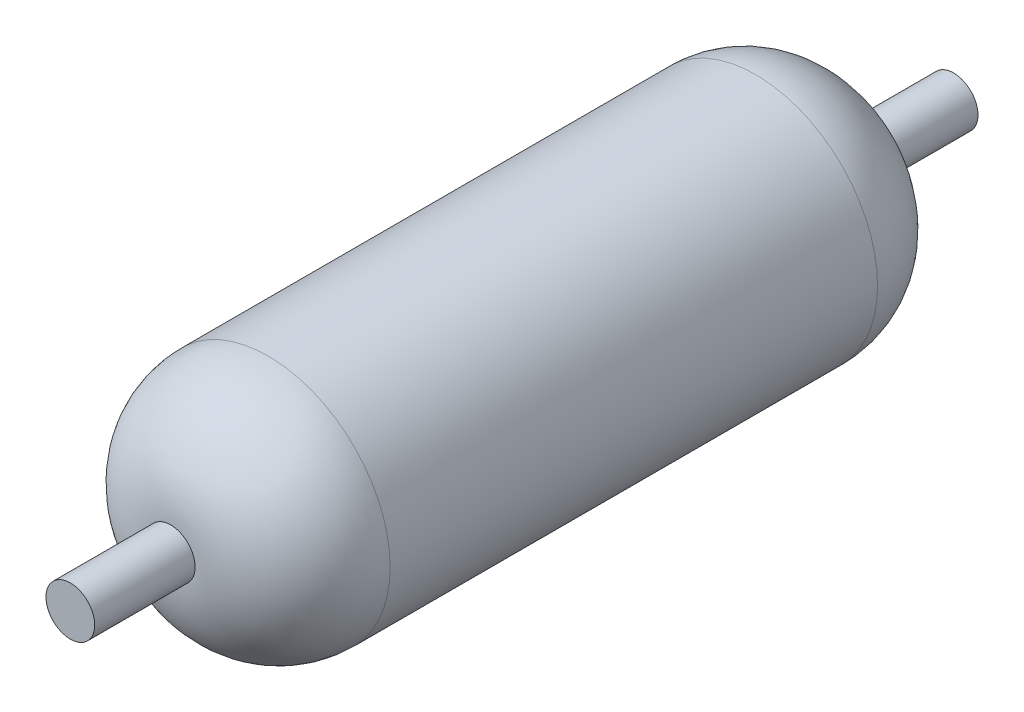
ISO-10303-21;
HEADER;
FILE_DESCRIPTION(('STEP AP214'),'2;1');
FILE_NAME('part.step','',(''),(''),'','','');
FILE_SCHEMA(('AUTOMOTIVE_DESIGN { 1 0 10303 214 1 1 1 1 }'));
ENDSEC;
DATA;
#1=APPLICATION_CONTEXT('core data for automotive mechanical design processes');
#2=APPLICATION_PROTOCOL_DEFINITION('international standard','automotive_design',2000,#1);
#3=PRODUCT_CONTEXT('',#1,'mechanical');
#4=PRODUCT('Part','Part','',(#3));
#5=PRODUCT_RELATED_PRODUCT_CATEGORY('part','',(#4));
#6=PRODUCT_DEFINITION_FORMATION('','',#4);
#7=PRODUCT_DEFINITION_CONTEXT('part definition',#1,'design');
#8=PRODUCT_DEFINITION('design','',#6,#7);
#9=PRODUCT_DEFINITION_SHAPE('','',#8);
#10=(LENGTH_UNIT() NAMED_UNIT(*) SI_UNIT(.MILLI.,.METRE.));
#11=(NAMED_UNIT(*) PLANE_ANGLE_UNIT() SI_UNIT($,.RADIAN.));
#12=(NAMED_UNIT(*) SI_UNIT($,.STERADIAN.) SOLID_ANGLE_UNIT());
#13=UNCERTAINTY_MEASURE_WITH_UNIT(LENGTH_MEASURE(1.E-05),#10,'distance_accuracy_value','');
#14=(GEOMETRIC_REPRESENTATION_CONTEXT(3) GLOBAL_UNCERTAINTY_ASSIGNED_CONTEXT((#13)) GLOBAL_UNIT_ASSIGNED_CONTEXT((#10,
#11,#12)) REPRESENTATION_CONTEXT('',''));
#15=CARTESIAN_POINT('',(0.,0.,0.));
#16=DIRECTION('',(0.,0.,1.));
#17=DIRECTION('',(1.,0.,0.));
#18=AXIS2_PLACEMENT_3D('',#15,#16,#17);
#19=CARTESIAN_POINT('',(0.,0.,4.53));
#20=DIRECTION('',(0.,0.,-1.));
#21=DIRECTION('',(-1.,0.,0.));
#22=AXIS2_PLACEMENT_3D('',#19,#20,#21);
#23=CYLINDRICAL_SURFACE('',#22,0.25);
#24=CARTESIAN_POINT('',(0.,0.,4.53));
#25=DIRECTION('',(0.,0.,1.));
#26=DIRECTION('',(1.,0.,0.));
#27=AXIS2_PLACEMENT_3D('',#24,#25,#26);
#28=CIRCLE('',#27,0.25);
#29=CARTESIAN_POINT('',(0.25,0.,4.53));
#30=VERTEX_POINT('',#29);
#31=EDGE_CURVE('E11',#30,#30,#28,.T.);
#32=ORIENTED_EDGE('',*,*,#31,.F.);
#33=EDGE_LOOP('',(#32));
#34=FACE_BOUND('',#33,.T.);
#35=CARTESIAN_POINT('',(0.,0.,-4.53));
#36=DIRECTION('',(0.,0.,1.));
#37=DIRECTION('',(1.,0.,0.));
#38=AXIS2_PLACEMENT_3D('',#35,#36,#37);
#39=CIRCLE('',#38,0.25);
#40=CARTESIAN_POINT('',(0.25,0.,-4.53));
#41=VERTEX_POINT('',#40);
#42=EDGE_CURVE('E41',#41,#41,#39,.T.);
#43=ORIENTED_EDGE('',*,*,#42,.T.);
#44=EDGE_LOOP('',(#43));
#45=FACE_BOUND('',#44,.T.);
#46=ADVANCED_FACE('F38',(#34,#45),#23,.T.);
#47=CARTESIAN_POINT('',(0.,0.,4.53));
#48=DIRECTION('',(0.,0.,1.));
#49=DIRECTION('',(1.,0.,0.));
#50=AXIS2_PLACEMENT_3D('',#47,#48,#49);
#51=PLANE('',#50);
#52=ORIENTED_EDGE('',*,*,#31,.T.);
#53=EDGE_LOOP('',(#52));
#54=FACE_BOUND('',#53,.T.);
#55=ADVANCED_FACE('F53',(#54),#51,.T.);
#56=CARTESIAN_POINT('',(0.,0.,-4.53));
#57=DIRECTION('',(0.,0.,1.));
#58=DIRECTION('',(1.,0.,0.));
#59=AXIS2_PLACEMENT_3D('',#56,#57,#58);
#60=PLANE('',#59);
#61=ORIENTED_EDGE('',*,*,#42,.F.);
#62=EDGE_LOOP('',(#61));
#63=FACE_BOUND('',#62,.T.);
#64=ADVANCED_FACE('F51',(#63),#60,.F.);
#65=CLOSED_SHELL('',(#46,#55,#64));
#66=MANIFOLD_SOLID_BREP('B2',#65);
#67=CARTESIAN_POINT('',(0.,0.,3.5));
#68=DIRECTION('',(0.,0.,-1.));
#69=DIRECTION('',(-1.,0.,0.));
#70=AXIS2_PLACEMENT_3D('',#67,#68,#69);
#71=CYLINDRICAL_SURFACE('',#70,1.25);
#72=CARTESIAN_POINT('',(0.,0.,2.5));
#73=DIRECTION('',(0.,0.,1.));
#74=DIRECTION('',(1.,0.,0.));
#75=AXIS2_PLACEMENT_3D('',#72,#73,#74);
#76=CIRCLE('',#75,1.25);
#77=CARTESIAN_POINT('',(1.25,0.,2.5));
#78=VERTEX_POINT('',#77);
#79=EDGE_CURVE('E85',#78,#78,#76,.F.);
#80=ORIENTED_EDGE('',*,*,#79,.T.);
#81=EDGE_LOOP('',(#80));
#82=FACE_BOUND('',#81,.T.);
#83=CARTESIAN_POINT('',(0.,0.,-2.5));
#84=DIRECTION('',(0.,0.,1.));
#85=DIRECTION('',(1.,0.,0.));
#86=AXIS2_PLACEMENT_3D('',#83,#84,#85);
#87=CIRCLE('',#86,1.25);
#88=CARTESIAN_POINT('',(1.25,0.,-2.5));
#89=VERTEX_POINT('',#88);
#90=EDGE_CURVE('E89',#89,#89,#87,.T.);
#91=ORIENTED_EDGE('',*,*,#90,.T.);
#92=EDGE_LOOP('',(#91));
#93=FACE_BOUND('',#92,.T.);
#94=ADVANCED_FACE('F78',(#82,#93),#71,.T.);
#95=CARTESIAN_POINT('',(0.,0.,3.5));
#96=DIRECTION('',(0.,0.,1.));
#97=DIRECTION('',(1.,0.,0.));
#98=AXIS2_PLACEMENT_3D('',#95,#96,#97);
#99=PLANE('',#98);
#100=CARTESIAN_POINT('',(0.,0.,3.5));
#101=DIRECTION('',(0.,0.,1.));
#102=DIRECTION('',(1.,0.,0.));
#103=AXIS2_PLACEMENT_3D('',#100,#101,#102);
#104=CIRCLE('',#103,0.25);
#105=CARTESIAN_POINT('',(0.25,0.,3.5));
#106=VERTEX_POINT('',#105);
#107=EDGE_CURVE('E93',#106,#106,#104,.T.);
#108=ORIENTED_EDGE('',*,*,#107,.T.);
#109=EDGE_LOOP('',(#108));
#110=FACE_BOUND('',#109,.T.);
#111=ADVANCED_FACE('F99',(#110),#99,.T.);
#112=CARTESIAN_POINT('',(0.,0.,-3.5));
#113=DIRECTION('',(0.,0.,1.));
#114=DIRECTION('',(1.,0.,0.));
#115=AXIS2_PLACEMENT_3D('',#112,#113,#114);
#116=PLANE('',#115);
#117=CARTESIAN_POINT('',(0.,0.,-3.5));
#118=DIRECTION('',(0.,0.,1.));
#119=DIRECTION('',(1.,0.,0.));
#120=AXIS2_PLACEMENT_3D('',#117,#118,#119);
#121=CIRCLE('',#120,0.25);
#122=CARTESIAN_POINT('',(0.25,0.,-3.5));
#123=VERTEX_POINT('',#122);
#124=EDGE_CURVE('E37',#123,#123,#121,.F.);
#125=ORIENTED_EDGE('',*,*,#124,.T.);
#126=EDGE_LOOP('',(#125));
#127=FACE_BOUND('',#126,.T.);
#128=ADVANCED_FACE('F103',(#127),#116,.F.);
#129=CARTESIAN_POINT('',(0.,0.,2.5));
#130=DIRECTION('',(0.,0.,1.));
#131=DIRECTION('',(1.,0.,0.));
#132=AXIS2_PLACEMENT_3D('',#129,#130,#131);
#133=DEGENERATE_TOROIDAL_SURFACE('',#132,0.25,1.,.T.);
#134=ORIENTED_EDGE('',*,*,#79,.F.);
#135=EDGE_LOOP('',(#134));
#136=FACE_BOUND('',#135,.T.);
#137=ORIENTED_EDGE('',*,*,#107,.F.);
#138=EDGE_LOOP('',(#137));
#139=FACE_BOUND('',#138,.T.);
#140=ADVANCED_FACE('F101',(#136,#139),#133,.T.);
#141=CARTESIAN_POINT('',(0.,0.,-2.5));
#142=DIRECTION('',(0.,0.,1.));
#143=DIRECTION('',(1.,0.,0.));
#144=AXIS2_PLACEMENT_3D('',#141,#142,#143);
#145=DEGENERATE_TOROIDAL_SURFACE('',#144,0.25,1.,.T.);
#146=ORIENTED_EDGE('',*,*,#124,.F.);
#147=EDGE_LOOP('',(#146));
#148=FACE_BOUND('',#147,.T.);
#149=ORIENTED_EDGE('',*,*,#90,.F.);
#150=EDGE_LOOP('',(#149));
#151=FACE_BOUND('',#150,.T.);
#152=ADVANCED_FACE('F80',(#148,#151),#145,.T.);
#153=CLOSED_SHELL('',(#94,#111,#128,#140,#152));
#154=MANIFOLD_SOLID_BREP('B6',#153);
#155=ADVANCED_BREP_SHAPE_REPRESENTATION('',(#18,#66,#154),#14);
#156=SHAPE_DEFINITION_REPRESENTATION(#9,#155);
ENDSEC;
END-ISO-10303-21;
